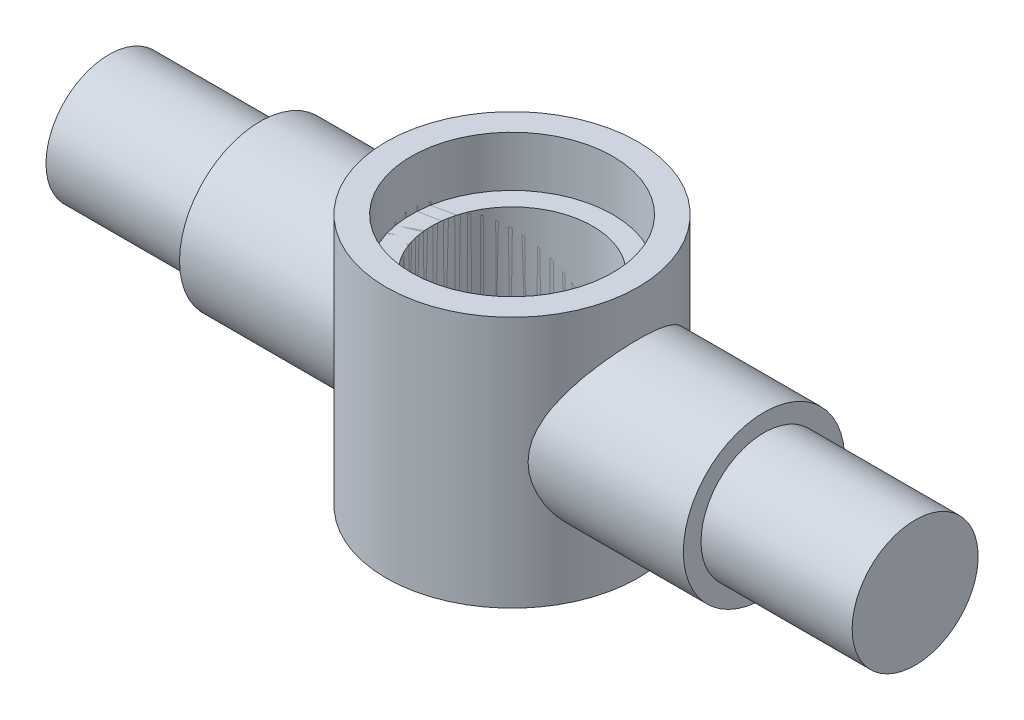
ISO-10303-21;
HEADER;
FILE_DESCRIPTION(('STEP AP214'),'2;1');
FILE_NAME('part.step','',(''),(''),'','','');
FILE_SCHEMA(('AUTOMOTIVE_DESIGN { 1 0 10303 214 1 1 1 1 }'));
ENDSEC;
DATA;
#1=APPLICATION_CONTEXT('core data for automotive mechanical design processes');
#2=APPLICATION_PROTOCOL_DEFINITION('international standard','automotive_design',2000,#1);
#3=PRODUCT_CONTEXT('',#1,'mechanical');
#4=PRODUCT('Part','Part','',(#3));
#5=PRODUCT_RELATED_PRODUCT_CATEGORY('part','',(#4));
#6=PRODUCT_DEFINITION_FORMATION('','',#4);
#7=PRODUCT_DEFINITION_CONTEXT('part definition',#1,'design');
#8=PRODUCT_DEFINITION('design','',#6,#7);
#9=PRODUCT_DEFINITION_SHAPE('','',#8);
#10=(LENGTH_UNIT() NAMED_UNIT(*) SI_UNIT(.MILLI.,.METRE.));
#11=(NAMED_UNIT(*) PLANE_ANGLE_UNIT() SI_UNIT($,.RADIAN.));
#12=(NAMED_UNIT(*) SI_UNIT($,.STERADIAN.) SOLID_ANGLE_UNIT());
#13=UNCERTAINTY_MEASURE_WITH_UNIT(LENGTH_MEASURE(1.E-05),#10,'distance_accuracy_value','');
#14=(GEOMETRIC_REPRESENTATION_CONTEXT(3) GLOBAL_UNCERTAINTY_ASSIGNED_CONTEXT((#13)) GLOBAL_UNIT_ASSIGNED_CONTEXT((#10,
#11,#12)) REPRESENTATION_CONTEXT('',''));
#15=CARTESIAN_POINT('',(0.,0.,0.));
#16=DIRECTION('',(0.,0.,1.));
#17=DIRECTION('',(1.,0.,0.));
#18=AXIS2_PLACEMENT_3D('',#15,#16,#17);
#19=CARTESIAN_POINT('',(50.,0.,0.));
#20=DIRECTION('',(-1.,0.,0.));
#21=DIRECTION('',(0.,0.,1.));
#22=AXIS2_PLACEMENT_3D('',#19,#20,#21);
#23=CYLINDRICAL_SURFACE('',#22,16.);
#24=CARTESIAN_POINT('',(50.,0.,0.));
#25=DIRECTION('',(-1.,0.,0.));
#26=DIRECTION('',(0.,0.,1.));
#27=AXIS2_PLACEMENT_3D('',#24,#25,#26);
#28=CIRCLE('',#27,16.);
#29=CARTESIAN_POINT('',(50.,0.,16.));
#30=VERTEX_POINT('',#29);
#31=EDGE_CURVE('E105',#30,#30,#28,.T.);
#32=ORIENTED_EDGE('',*,*,#31,.T.);
#33=EDGE_LOOP('',(#32));
#34=FACE_BOUND('',#33,.T.);
#35=CARTESIAN_POINT('',(0.,0.,0.));
#36=DIRECTION('',(-0.707106781186547,0.707106781186547,0.));
#37=DIRECTION('',(-0.707106781186547,-0.707106781186547,0.));
#38=AXIS2_PLACEMENT_3D('',#35,#36,#37);
#39=ELLIPSE('',#38,22.6274169979695,16.);
#40=CARTESIAN_POINT('',(15.,15.,-5.56776436283002));
#41=VERTEX_POINT('',#40);
#42=CARTESIAN_POINT('',(0.,0.,-16.));
#43=VERTEX_POINT('',#42);
#44=EDGE_CURVE('E104',#41,#43,#39,.T.);
#45=ORIENTED_EDGE('',*,*,#44,.F.);
#46=DIRECTION('',(-1.,0.,0.));
#47=VECTOR('',#46,1.);
#48=CARTESIAN_POINT('',(50.,15.,-5.56776436283002));
#49=LINE('',#48,#47);
#50=CARTESIAN_POINT('',(19.2093727122985,15.,-5.56776436283002));
#51=VERTEX_POINT('',#50);
#52=EDGE_CURVE('E74',#41,#51,#49,.F.);
#53=ORIENTED_EDGE('',*,*,#52,.T.);
#54=CARTESIAN_POINT('',(19.2093727122985,15.,5.56776436283002));
#55=CARTESIAN_POINT('',(19.2570722769017,15.0610843974144,5.40319823612548));
#56=CARTESIAN_POINT('',(19.3029026937333,15.119631317342,5.23716502037859));
#57=CARTESIAN_POINT('',(19.3906499520987,15.2314974319572,4.90231147721467));
#58=CARTESIAN_POINT('',(19.4325664726034,15.2848161978344,4.73349092250614));
#59=CARTESIAN_POINT('',(19.5521943571649,15.4367163959637,4.22300978678801));
#60=CARTESIAN_POINT('',(19.623755809574,15.5272056554045,3.87742660549749));
#61=CARTESIAN_POINT('',(19.7490205566925,15.6852200560767,3.17838528016678));
#62=CARTESIAN_POINT('',(19.8027473683976,15.7527754409121,2.82493816750092));
#63=CARTESIAN_POINT('',(19.8914116892333,15.8640913123135,2.11203830883464));
#64=CARTESIAN_POINT('',(19.9263531659297,15.9078568234531,1.75258684753462));
#65=CARTESIAN_POINT('',(19.9768261518278,15.9710346202693,1.02883043507966));
#66=CARTESIAN_POINT('',(19.9922848849315,15.9903555965401,0.664512393490593));
#67=CARTESIAN_POINT('',(20.0032212274794,16.0040268664456,-0.064936863983728));
#68=CARTESIAN_POINT('',(19.9986963716622,15.9983740792098,-0.43006817464368));
#69=CARTESIAN_POINT('',(19.9697637004135,15.9621922570005,-1.15807525390504));
#70=CARTESIAN_POINT('',(19.945368489825,15.9316789923719,-1.52095230550352));
#71=CARTESIAN_POINT('',(19.8772547150228,15.8463215570645,-2.24184998072597));
#72=CARTESIAN_POINT('',(19.8335409867375,15.7914834755083,-2.59987179663911));
#73=CARTESIAN_POINT('',(19.7133355226433,15.6402771688391,-3.40461127592164));
#74=CARTESIAN_POINT('',(19.6311796039386,15.5366923945717,-3.84916730510305));
#75=CARTESIAN_POINT('',(19.4876369410127,15.3547828640477,-4.50355000017725));
#76=CARTESIAN_POINT('',(19.4364367900132,15.2897653777358,-4.71949222958349));
#77=CARTESIAN_POINT('',(19.3276235537983,15.1512000198568,-5.14699780777976));
#78=CARTESIAN_POINT('',(19.2700100714192,15.0776516199771,-5.35856088441518));
#79=CARTESIAN_POINT('',(19.2093727122985,15.,-5.56776436283002));
#80=B_SPLINE_CURVE_WITH_KNOTS('',3,(#54,#55,#56,#57,#58,#59,#60,#61,#62,#63,#64,#65,#66,#67,#68,
#69,#70,#71,#72,#73,#74,#75,#76,#77,#78,#79),.UNSPECIFIED.,.F.,.F.,(4,2,2,2,2,2,2,2,2,2,2,2,4),
(0.,0.545641347785289,1.09132741142298,2.18302010414526,3.27326750446169,4.36328454799356,
5.45736130288515,6.55157303154729,7.64509118249189,8.73833575226914,10.1268579063309,
10.820391136294,11.5139673391748),.UNSPECIFIED.);
#81=CARTESIAN_POINT('',(19.2093727122985,15.,5.56776436283002));
#82=VERTEX_POINT('',#81);
#83=EDGE_CURVE('E12',#82,#51,#80,.T.);
#84=ORIENTED_EDGE('',*,*,#83,.F.);
#85=DIRECTION('',(-1.,0.,0.));
#86=VECTOR('',#85,1.);
#87=CARTESIAN_POINT('',(50.,15.,5.56776436283002));
#88=LINE('',#87,#86);
#89=CARTESIAN_POINT('',(15.,15.,5.56776436283002));
#90=VERTEX_POINT('',#89);
#91=EDGE_CURVE('E93',#82,#90,#88,.T.);
#92=ORIENTED_EDGE('',*,*,#91,.T.);
#93=CARTESIAN_POINT('',(0.,0.,16.));
#94=VERTEX_POINT('',#93);
#95=EDGE_CURVE('E111',#94,#90,#39,.T.);
#96=ORIENTED_EDGE('',*,*,#95,.F.);
#97=CARTESIAN_POINT('',(0.,0.,0.));
#98=DIRECTION('',(-0.707106781186547,-0.707106781186547,0.));
#99=DIRECTION('',(-0.707106781186547,0.707106781186547,0.));
#100=AXIS2_PLACEMENT_3D('',#97,#98,#99);
#101=ELLIPSE('',#100,22.6274169979695,16.);
#102=EDGE_CURVE('E83',#43,#94,#101,.T.);
#103=ORIENTED_EDGE('',*,*,#102,.F.);
#104=EDGE_LOOP('',(#45,#53,#84,#92,#96,#103));
#105=FACE_BOUND('',#104,.T.);
#106=ADVANCED_FACE('F54',(#34,#105),#23,.T.);
#107=CARTESIAN_POINT('',(0.,-25.,0.));
#108=DIRECTION('',(0.,1.,0.));
#109=DIRECTION('',(0.,0.,1.));
#110=AXIS2_PLACEMENT_3D('',#107,#108,#109);
#111=CYLINDRICAL_SURFACE('',#110,16.);
#112=CARTESIAN_POINT('',(0.,15.,0.));
#113=DIRECTION('',(0.,1.,0.));
#114=DIRECTION('',(0.,0.,1.));
#115=AXIS2_PLACEMENT_3D('',#112,#113,#114);
#116=CIRCLE('',#115,16.);
#117=EDGE_CURVE('E67',#41,#90,#116,.F.);
#118=ORIENTED_EDGE('',*,*,#117,.F.);
#119=ORIENTED_EDGE('',*,*,#44,.T.);
#120=ORIENTED_EDGE('',*,*,#102,.T.);
#121=ORIENTED_EDGE('',*,*,#95,.T.);
#122=EDGE_LOOP('',(#118,#119,#120,#121));
#123=FACE_BOUND('',#122,.T.);
#124=ADVANCED_FACE('F56',(#123),#111,.F.);
#125=CARTESIAN_POINT('',(80.,0.,12.5));
#126=DIRECTION('',(1.,0.,0.));
#127=DIRECTION('',(0.,0.,-1.));
#128=AXIS2_PLACEMENT_3D('',#125,#126,#127);
#129=PLANE('',#128);
#130=CARTESIAN_POINT('',(80.,0.,0.));
#131=DIRECTION('',(-1.,0.,0.));
#132=DIRECTION('',(0.,0.,1.));
#133=AXIS2_PLACEMENT_3D('',#130,#131,#132);
#134=CIRCLE('',#133,12.5);
#135=CARTESIAN_POINT('',(80.,0.,12.5));
#136=VERTEX_POINT('',#135);
#137=EDGE_CURVE('E116',#136,#136,#134,.T.);
#138=ORIENTED_EDGE('',*,*,#137,.F.);
#139=EDGE_LOOP('',(#138));
#140=FACE_BOUND('',#139,.T.);
#141=ADVANCED_FACE('F121',(#140),#129,.T.);
#142=CARTESIAN_POINT('',(50.,0.,16.));
#143=DIRECTION('',(1.,0.,0.));
#144=DIRECTION('',(0.,0.,-1.));
#145=AXIS2_PLACEMENT_3D('',#142,#143,#144);
#146=PLANE('',#145);
#147=CARTESIAN_POINT('',(50.,0.,0.));
#148=DIRECTION('',(-1.,0.,0.));
#149=DIRECTION('',(0.,0.,1.));
#150=AXIS2_PLACEMENT_3D('',#147,#148,#149);
#151=CIRCLE('',#150,12.5);
#152=CARTESIAN_POINT('',(50.,0.,12.5));
#153=VERTEX_POINT('',#152);
#154=EDGE_CURVE('E108',#153,#153,#151,.T.);
#155=ORIENTED_EDGE('',*,*,#154,.T.);
#156=EDGE_LOOP('',(#155));
#157=FACE_BOUND('',#156,.T.);
#158=ORIENTED_EDGE('',*,*,#31,.F.);
#159=EDGE_LOOP('',(#158));
#160=FACE_BOUND('',#159,.T.);
#161=ADVANCED_FACE('F126',(#157,#160),#146,.T.);
#162=CARTESIAN_POINT('',(50.,0.,0.));
#163=DIRECTION('',(-1.,0.,0.));
#164=DIRECTION('',(0.,0.,1.));
#165=AXIS2_PLACEMENT_3D('',#162,#163,#164);
#166=CYLINDRICAL_SURFACE('',#165,12.5);
#167=ORIENTED_EDGE('',*,*,#137,.T.);
#168=EDGE_LOOP('',(#167));
#169=FACE_BOUND('',#168,.T.);
#170=ORIENTED_EDGE('',*,*,#154,.F.);
#171=EDGE_LOOP('',(#170));
#172=FACE_BOUND('',#171,.T.);
#173=ADVANCED_FACE('F134',(#169,#172),#166,.T.);
#174=CARTESIAN_POINT('',(0.,15.,0.));
#175=DIRECTION('',(0.,1.,0.));
#176=DIRECTION('',(0.,0.,1.));
#177=AXIS2_PLACEMENT_3D('',#174,#175,#176);
#178=CYLINDRICAL_SURFACE('',#177,20.);
#179=ORIENTED_EDGE('',*,*,#83,.T.);
#180=CARTESIAN_POINT('',(0.,15.,0.));
#181=DIRECTION('',(0.,1.,0.));
#182=DIRECTION('',(0.,0.,1.));
#183=AXIS2_PLACEMENT_3D('',#180,#181,#182);
#184=CIRCLE('',#183,20.);
#185=EDGE_CURVE('E96',#82,#51,#184,.T.);
#186=ORIENTED_EDGE('',*,*,#185,.F.);
#187=EDGE_LOOP('',(#179,#186));
#188=FACE_BOUND('',#187,.T.);
#189=ADVANCED_FACE('F101',(#188),#178,.F.);
#190=CARTESIAN_POINT('',(0.,15.,0.));
#191=DIRECTION('',(0.,1.,0.));
#192=DIRECTION('',(0.,0.,1.));
#193=AXIS2_PLACEMENT_3D('',#190,#191,#192);
#194=PLANE('',#193);
#195=ORIENTED_EDGE('',*,*,#117,.T.);
#196=ORIENTED_EDGE('',*,*,#91,.F.);
#197=ORIENTED_EDGE('',*,*,#185,.T.);
#198=ORIENTED_EDGE('',*,*,#52,.F.);
#199=EDGE_LOOP('',(#195,#196,#197,#198));
#200=FACE_BOUND('',#199,.T.);
#201=ADVANCED_FACE('F95',(#200),#194,.T.);
#202=CLOSED_SHELL('',(#106,#124,#141,#161,#173,#189,#201));
#203=MANIFOLD_SOLID_BREP('B2',#202);
#204=CARTESIAN_POINT('',(0.,25.,0.));
#205=DIRECTION('',(0.,-1.,0.));
#206=DIRECTION('',(0.,0.,-1.));
#207=AXIS2_PLACEMENT_3D('',#204,#205,#206);
#208=CYLINDRICAL_SURFACE('',#207,16.);
#209=CARTESIAN_POINT('',(0.,-25.,0.));
#210=DIRECTION('',(0.,1.,0.));
#211=DIRECTION('',(0.,0.,1.));
#212=AXIS2_PLACEMENT_3D('',#209,#210,#211);
#213=CIRCLE('',#212,16.);
#214=CARTESIAN_POINT('',(0.,-25.,16.));
#215=VERTEX_POINT('',#214);
#216=EDGE_CURVE('E225',#215,#215,#213,.T.);
#217=ORIENTED_EDGE('',*,*,#216,.F.);
#218=EDGE_LOOP('',(#217));
#219=FACE_BOUND('',#218,.T.);
#220=CARTESIAN_POINT('',(0.,15.,0.));
#221=DIRECTION('',(0.,1.,0.));
#222=DIRECTION('',(0.,0.,1.));
#223=AXIS2_PLACEMENT_3D('',#220,#221,#222);
#224=CIRCLE('',#223,16.);
#225=CARTESIAN_POINT('',(0.,15.,16.));
#226=VERTEX_POINT('',#225);
#227=EDGE_CURVE('E214',#226,#226,#224,.T.);
#228=ORIENTED_EDGE('',*,*,#227,.T.);
#229=EDGE_LOOP('',(#228));
#230=FACE_BOUND('',#229,.T.);
#231=ADVANCED_FACE('F211',(#219,#230),#208,.F.);
#232=CARTESIAN_POINT('',(0.,25.,0.));
#233=DIRECTION('',(0.,-1.,0.));
#234=DIRECTION('',(0.,0.,-1.));
#235=AXIS2_PLACEMENT_3D('',#232,#233,#234);
#236=CYLINDRICAL_SURFACE('',#235,25.);
#237=CARTESIAN_POINT('',(0.,25.,0.));
#238=DIRECTION('',(0.,1.,0.));
#239=DIRECTION('',(0.,0.,1.));
#240=AXIS2_PLACEMENT_3D('',#237,#238,#239);
#241=CIRCLE('',#240,25.);
#242=CARTESIAN_POINT('',(0.,25.,25.));
#243=VERTEX_POINT('',#242);
#244=EDGE_CURVE('E53',#243,#243,#241,.T.);
#245=ORIENTED_EDGE('',*,*,#244,.F.);
#246=EDGE_LOOP('',(#245));
#247=FACE_BOUND('',#246,.T.);
#248=CARTESIAN_POINT('',(0.,-25.,0.));
#249=DIRECTION('',(0.,1.,0.));
#250=DIRECTION('',(0.,0.,1.));
#251=AXIS2_PLACEMENT_3D('',#248,#249,#250);
#252=CIRCLE('',#251,25.);
#253=CARTESIAN_POINT('',(0.,-25.,25.));
#254=VERTEX_POINT('',#253);
#255=EDGE_CURVE('E219',#254,#254,#252,.T.);
#256=ORIENTED_EDGE('',*,*,#255,.T.);
#257=EDGE_LOOP('',(#256));
#258=FACE_BOUND('',#257,.T.);
#259=ADVANCED_FACE('F252',(#247,#258),#236,.T.);
#260=CARTESIAN_POINT('',(0.,25.,0.));
#261=DIRECTION('',(0.,1.,0.));
#262=DIRECTION('',(0.,0.,1.));
#263=AXIS2_PLACEMENT_3D('',#260,#261,#262);
#264=PLANE('',#263);
#265=CARTESIAN_POINT('',(0.,25.,0.));
#266=DIRECTION('',(0.,1.,0.));
#267=DIRECTION('',(0.,0.,1.));
#268=AXIS2_PLACEMENT_3D('',#265,#266,#267);
#269=CIRCLE('',#268,20.);
#270=CARTESIAN_POINT('',(0.,25.,20.));
#271=VERTEX_POINT('',#270);
#272=EDGE_CURVE('E228',#271,#271,#269,.T.);
#273=ORIENTED_EDGE('',*,*,#272,.F.);
#274=EDGE_LOOP('',(#273));
#275=FACE_BOUND('',#274,.T.);
#276=ORIENTED_EDGE('',*,*,#244,.T.);
#277=EDGE_LOOP('',(#276));
#278=FACE_BOUND('',#277,.T.);
#279=ADVANCED_FACE('F249',(#275,#278),#264,.T.);
#280=CARTESIAN_POINT('',(0.,-25.,0.));
#281=DIRECTION('',(0.,1.,0.));
#282=DIRECTION('',(0.,0.,1.));
#283=AXIS2_PLACEMENT_3D('',#280,#281,#282);
#284=PLANE('',#283);
#285=ORIENTED_EDGE('',*,*,#216,.T.);
#286=EDGE_LOOP('',(#285));
#287=FACE_BOUND('',#286,.T.);
#288=ORIENTED_EDGE('',*,*,#255,.F.);
#289=EDGE_LOOP('',(#288));
#290=FACE_BOUND('',#289,.T.);
#291=ADVANCED_FACE('F251',(#287,#290),#284,.F.);
#292=CARTESIAN_POINT('',(0.,15.,0.));
#293=DIRECTION('',(0.,1.,0.));
#294=DIRECTION('',(0.,0.,1.));
#295=AXIS2_PLACEMENT_3D('',#292,#293,#294);
#296=CYLINDRICAL_SURFACE('',#295,20.);
#297=CARTESIAN_POINT('',(0.,15.,0.));
#298=DIRECTION('',(0.,1.,0.));
#299=DIRECTION('',(0.,0.,1.));
#300=AXIS2_PLACEMENT_3D('',#297,#298,#299);
#301=CIRCLE('',#300,20.);
#302=CARTESIAN_POINT('',(0.,15.,20.));
#303=VERTEX_POINT('',#302);
#304=EDGE_CURVE('E236',#303,#303,#301,.T.);
#305=ORIENTED_EDGE('',*,*,#304,.F.);
#306=EDGE_LOOP('',(#305));
#307=FACE_BOUND('',#306,.T.);
#308=ORIENTED_EDGE('',*,*,#272,.T.);
#309=EDGE_LOOP('',(#308));
#310=FACE_BOUND('',#309,.T.);
#311=ADVANCED_FACE('F247',(#307,#310),#296,.F.);
#312=CARTESIAN_POINT('',(0.,15.,0.));
#313=DIRECTION('',(0.,1.,0.));
#314=DIRECTION('',(0.,0.,1.));
#315=AXIS2_PLACEMENT_3D('',#312,#313,#314);
#316=PLANE('',#315);
#317=ORIENTED_EDGE('',*,*,#227,.F.);
#318=EDGE_LOOP('',(#317));
#319=FACE_BOUND('',#318,.T.);
#320=ORIENTED_EDGE('',*,*,#304,.T.);
#321=EDGE_LOOP('',(#320));
#322=FACE_BOUND('',#321,.T.);
#323=ADVANCED_FACE('F287',(#319,#322),#316,.T.);
#324=CLOSED_SHELL('',(#231,#259,#279,#291,#311,#323));
#325=MANIFOLD_SOLID_BREP('B6',#324);
#326=CARTESIAN_POINT('',(50.,0.,0.));
#327=DIRECTION('',(-1.,0.,0.));
#328=DIRECTION('',(0.,0.,1.));
#329=AXIS2_PLACEMENT_3D('',#326,#327,#328);
#330=CYLINDRICAL_SURFACE('',#329,16.);
#331=CARTESIAN_POINT('',(-50.,0.,0.));
#332=DIRECTION('',(-1.,0.,0.));
#333=DIRECTION('',(0.,0.,1.));
#334=AXIS2_PLACEMENT_3D('',#331,#332,#333);
#335=CIRCLE('',#334,16.);
#336=CARTESIAN_POINT('',(-50.,0.,16.));
#337=VERTEX_POINT('',#336);
#338=EDGE_CURVE('E373',#337,#337,#335,.T.);
#339=ORIENTED_EDGE('',*,*,#338,.F.);
#340=EDGE_LOOP('',(#339));
#341=FACE_BOUND('',#340,.T.);
#342=CARTESIAN_POINT('',(-19.2093727122985,15.,-5.56776436283002));
#343=CARTESIAN_POINT('',(-19.2570722769017,15.0610843974144,-5.40319823612548));
#344=CARTESIAN_POINT('',(-19.3029026937333,15.119631317342,-5.23716502037859));
#345=CARTESIAN_POINT('',(-19.3906499520987,15.2314974319572,-4.90231147721467));
#346=CARTESIAN_POINT('',(-19.4325664726034,15.2848161978344,-4.73349092250614));
#347=CARTESIAN_POINT('',(-19.5521943571649,15.4367163959637,-4.22300978678801));
#348=CARTESIAN_POINT('',(-19.623755809574,15.5272056554045,-3.87742660549749));
#349=CARTESIAN_POINT('',(-19.7490205566925,15.6852200560767,-3.17838528016678));
#350=CARTESIAN_POINT('',(-19.8027473683976,15.7527754409121,-2.82493816750092));
#351=CARTESIAN_POINT('',(-19.8914116892333,15.8640913123135,-2.11203830883464));
#352=CARTESIAN_POINT('',(-19.9263531659297,15.9078568234531,-1.75258684753462));
#353=CARTESIAN_POINT('',(-19.9768261518278,15.9710346202693,-1.02883043507966));
#354=CARTESIAN_POINT('',(-19.9922848849315,15.9903555965401,-0.664512393490593));
#355=CARTESIAN_POINT('',(-20.0032212274794,16.0040268664456,0.064936863983728));
#356=CARTESIAN_POINT('',(-19.9986963716622,15.9983740792098,0.43006817464368));
#357=CARTESIAN_POINT('',(-19.9697637004135,15.9621922570005,1.15807525390504));
#358=CARTESIAN_POINT('',(-19.945368489825,15.9316789923719,1.52095230550352));
#359=CARTESIAN_POINT('',(-19.8772547150228,15.8463215570645,2.24184998072597));
#360=CARTESIAN_POINT('',(-19.8335409867375,15.7914834755083,2.59987179663911));
#361=CARTESIAN_POINT('',(-19.7133355226433,15.6402771688391,3.40461127592164));
#362=CARTESIAN_POINT('',(-19.6311796039386,15.5366923945717,3.84916730510305));
#363=CARTESIAN_POINT('',(-19.4876369410127,15.3547828640477,4.50355000017725));
#364=CARTESIAN_POINT('',(-19.4364367900132,15.2897653777358,4.71949222958349));
#365=CARTESIAN_POINT('',(-19.3276235537983,15.1512000198568,5.14699780777976));
#366=CARTESIAN_POINT('',(-19.2700100714192,15.0776516199771,5.35856088441518));
#367=CARTESIAN_POINT('',(-19.2093727122985,15.,5.56776436283002));
#368=B_SPLINE_CURVE_WITH_KNOTS('',3,(#342,#343,#344,#345,#346,#347,#348,#349,#350,#351,#352,
#353,#354,#355,#356,#357,#358,#359,#360,#361,#362,#363,#364,#365,#366,#367),.UNSPECIFIED.,.F.,
.F.,(4,2,2,2,2,2,2,2,2,2,2,2,4),(0.,0.545641347785289,1.09132741142298,2.18302010414526,
3.27326750446169,4.36328454799356,5.45736130288515,6.55157303154729,7.64509118249189,
8.73833575226914,10.1268579063309,10.820391136294,11.5139673391748),.UNSPECIFIED.);
#369=CARTESIAN_POINT('',(-19.2093727122985,15.,-5.56776436283002));
#370=VERTEX_POINT('',#369);
#371=CARTESIAN_POINT('',(-19.2093727122985,15.,5.56776436283002));
#372=VERTEX_POINT('',#371);
#373=EDGE_CURVE('E209',#370,#372,#368,.T.);
#374=ORIENTED_EDGE('',*,*,#373,.F.);
#375=DIRECTION('',(-1.,0.,0.));
#376=VECTOR('',#375,1.);
#377=CARTESIAN_POINT('',(50.,15.,-5.56776436283002));
#378=LINE('',#377,#376);
#379=CARTESIAN_POINT('',(-15.,15.,-5.56776436283002));
#380=VERTEX_POINT('',#379);
#381=EDGE_CURVE('E367',#370,#380,#378,.F.);
#382=ORIENTED_EDGE('',*,*,#381,.T.);
#383=CARTESIAN_POINT('',(0.,0.,0.));
#384=DIRECTION('',(-0.707106781186547,-0.707106781186547,0.));
#385=DIRECTION('',(-0.707106781186547,0.707106781186547,0.));
#386=AXIS2_PLACEMENT_3D('',#383,#384,#385);
#387=ELLIPSE('',#386,22.6274169979695,16.);
#388=CARTESIAN_POINT('',(0.,0.,-16.));
#389=VERTEX_POINT('',#388);
#390=EDGE_CURVE('E390',#389,#380,#387,.F.);
#391=ORIENTED_EDGE('',*,*,#390,.F.);
#392=CARTESIAN_POINT('',(0.,0.,0.));
#393=DIRECTION('',(-0.707106781186547,0.707106781186547,0.));
#394=DIRECTION('',(-0.707106781186547,-0.707106781186547,0.));
#395=AXIS2_PLACEMENT_3D('',#392,#393,#394);
#396=ELLIPSE('',#395,22.6274169979695,16.);
#397=CARTESIAN_POINT('',(0.,0.,16.));
#398=VERTEX_POINT('',#397);
#399=EDGE_CURVE('E356',#398,#389,#396,.F.);
#400=ORIENTED_EDGE('',*,*,#399,.F.);
#401=CARTESIAN_POINT('',(-15.,15.,5.56776436283002));
#402=VERTEX_POINT('',#401);
#403=EDGE_CURVE('E379',#402,#398,#387,.F.);
#404=ORIENTED_EDGE('',*,*,#403,.F.);
#405=DIRECTION('',(-1.,0.,0.));
#406=VECTOR('',#405,1.);
#407=CARTESIAN_POINT('',(50.,15.,5.56776436283002));
#408=LINE('',#407,#406);
#409=EDGE_CURVE('E348',#402,#372,#408,.T.);
#410=ORIENTED_EDGE('',*,*,#409,.T.);
#411=EDGE_LOOP('',(#374,#382,#391,#400,#404,#410));
#412=FACE_BOUND('',#411,.T.);
#413=ADVANCED_FACE('F327',(#341,#412),#330,.T.);
#414=CARTESIAN_POINT('',(0.,-25.,0.));
#415=DIRECTION('',(0.,1.,0.));
#416=DIRECTION('',(0.,0.,1.));
#417=AXIS2_PLACEMENT_3D('',#414,#415,#416);
#418=CYLINDRICAL_SURFACE('',#417,16.);
#419=CARTESIAN_POINT('',(0.,15.,0.));
#420=DIRECTION('',(0.,1.,0.));
#421=DIRECTION('',(0.,0.,1.));
#422=AXIS2_PLACEMENT_3D('',#419,#420,#421);
#423=CIRCLE('',#422,16.);
#424=EDGE_CURVE('E341',#402,#380,#423,.F.);
#425=ORIENTED_EDGE('',*,*,#424,.F.);
#426=ORIENTED_EDGE('',*,*,#403,.T.);
#427=ORIENTED_EDGE('',*,*,#399,.T.);
#428=ORIENTED_EDGE('',*,*,#390,.T.);
#429=EDGE_LOOP('',(#425,#426,#427,#428));
#430=FACE_BOUND('',#429,.T.);
#431=ADVANCED_FACE('F392',(#430),#418,.F.);
#432=CARTESIAN_POINT('',(-80.,0.,12.5));
#433=DIRECTION('',(-1.,0.,0.));
#434=DIRECTION('',(0.,0.,1.));
#435=AXIS2_PLACEMENT_3D('',#432,#433,#434);
#436=PLANE('',#435);
#437=CARTESIAN_POINT('',(-80.,0.,0.));
#438=DIRECTION('',(-1.,0.,0.));
#439=DIRECTION('',(0.,0.,1.));
#440=AXIS2_PLACEMENT_3D('',#437,#438,#439);
#441=CIRCLE('',#440,12.5);
#442=CARTESIAN_POINT('',(-80.,0.,12.5));
#443=VERTEX_POINT('',#442);
#444=EDGE_CURVE('E387',#443,#443,#441,.T.);
#445=ORIENTED_EDGE('',*,*,#444,.T.);
#446=EDGE_LOOP('',(#445));
#447=FACE_BOUND('',#446,.T.);
#448=ADVANCED_FACE('F329',(#447),#436,.T.);
#449=CARTESIAN_POINT('',(50.,0.,0.));
#450=DIRECTION('',(-1.,0.,0.));
#451=DIRECTION('',(0.,0.,1.));
#452=AXIS2_PLACEMENT_3D('',#449,#450,#451);
#453=CYLINDRICAL_SURFACE('',#452,12.5);
#454=CARTESIAN_POINT('',(-50.,0.,0.));
#455=DIRECTION('',(-1.,0.,0.));
#456=DIRECTION('',(0.,0.,1.));
#457=AXIS2_PLACEMENT_3D('',#454,#455,#456);
#458=CIRCLE('',#457,12.5);
#459=CARTESIAN_POINT('',(-50.,0.,12.5));
#460=VERTEX_POINT('',#459);
#461=EDGE_CURVE('E384',#460,#460,#458,.T.);
#462=ORIENTED_EDGE('',*,*,#461,.T.);
#463=EDGE_LOOP('',(#462));
#464=FACE_BOUND('',#463,.T.);
#465=ORIENTED_EDGE('',*,*,#444,.F.);
#466=EDGE_LOOP('',(#465));
#467=FACE_BOUND('',#466,.T.);
#468=ADVANCED_FACE('F399',(#464,#467),#453,.T.);
#469=CARTESIAN_POINT('',(-50.,0.,16.));
#470=DIRECTION('',(-1.,0.,0.));
#471=DIRECTION('',(0.,0.,1.));
#472=AXIS2_PLACEMENT_3D('',#469,#470,#471);
#473=PLANE('',#472);
#474=ORIENTED_EDGE('',*,*,#338,.T.);
#475=EDGE_LOOP('',(#474));
#476=FACE_BOUND('',#475,.T.);
#477=ORIENTED_EDGE('',*,*,#461,.F.);
#478=EDGE_LOOP('',(#477));
#479=FACE_BOUND('',#478,.T.);
#480=ADVANCED_FACE('F406',(#476,#479),#473,.T.);
#481=CARTESIAN_POINT('',(0.,15.,0.));
#482=DIRECTION('',(0.,1.,0.));
#483=DIRECTION('',(0.,0.,1.));
#484=AXIS2_PLACEMENT_3D('',#481,#482,#483);
#485=CYLINDRICAL_SURFACE('',#484,20.);
#486=ORIENTED_EDGE('',*,*,#373,.T.);
#487=CARTESIAN_POINT('',(0.,15.,0.));
#488=DIRECTION('',(0.,1.,0.));
#489=DIRECTION('',(0.,0.,1.));
#490=AXIS2_PLACEMENT_3D('',#487,#488,#489);
#491=CIRCLE('',#490,20.);
#492=EDGE_CURVE('E370',#370,#372,#491,.T.);
#493=ORIENTED_EDGE('',*,*,#492,.F.);
#494=EDGE_LOOP('',(#486,#493));
#495=FACE_BOUND('',#494,.T.);
#496=ADVANCED_FACE('F376',(#495),#485,.F.);
#497=CARTESIAN_POINT('',(0.,15.,0.));
#498=DIRECTION('',(0.,1.,0.));
#499=DIRECTION('',(0.,0.,1.));
#500=AXIS2_PLACEMENT_3D('',#497,#498,#499);
#501=PLANE('',#500);
#502=ORIENTED_EDGE('',*,*,#492,.T.);
#503=ORIENTED_EDGE('',*,*,#409,.F.);
#504=ORIENTED_EDGE('',*,*,#424,.T.);
#505=ORIENTED_EDGE('',*,*,#381,.F.);
#506=EDGE_LOOP('',(#502,#503,#504,#505));
#507=FACE_BOUND('',#506,.T.);
#508=ADVANCED_FACE('F369',(#507),#501,.T.);
#509=CLOSED_SHELL('',(#413,#431,#448,#468,#480,#496,#508));
#510=MANIFOLD_SOLID_BREP('B48',#509);
#511=ADVANCED_BREP_SHAPE_REPRESENTATION('',(#18,#203,#325,#510),#14);
#512=SHAPE_DEFINITION_REPRESENTATION(#9,#511);
ENDSEC;
END-ISO-10303-21;
